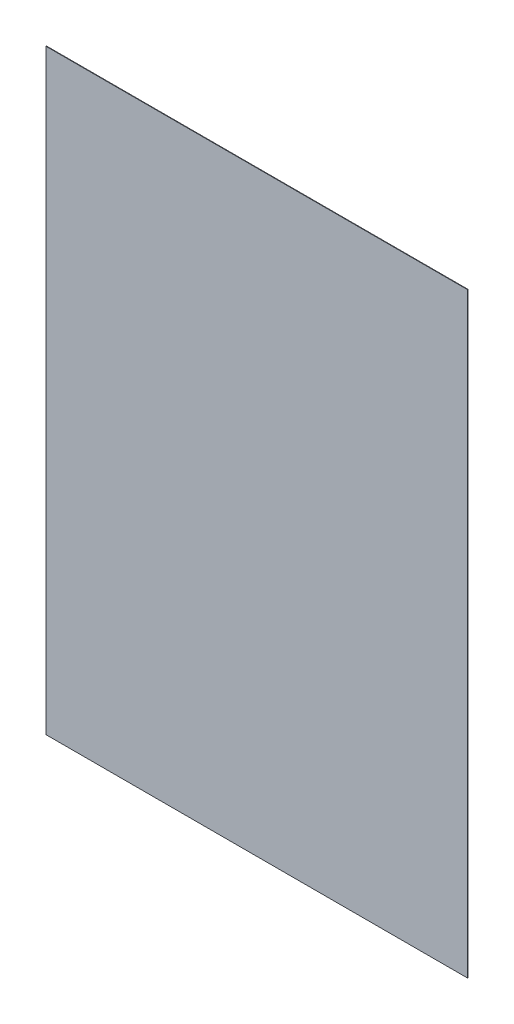
ISO-10303-21;
HEADER;
FILE_DESCRIPTION(('STEP AP214'),'2;1');
FILE_NAME('part.step','',(''),(''),'','','');
FILE_SCHEMA(('AUTOMOTIVE_DESIGN { 1 0 10303 214 1 1 1 1 }'));
ENDSEC;
DATA;
#1=APPLICATION_CONTEXT('core data for automotive mechanical design processes');
#2=APPLICATION_PROTOCOL_DEFINITION('international standard','automotive_design',2000,#1);
#3=PRODUCT_CONTEXT('',#1,'mechanical');
#4=PRODUCT('Part','Part','',(#3));
#5=PRODUCT_RELATED_PRODUCT_CATEGORY('part','',(#4));
#6=PRODUCT_DEFINITION_FORMATION('','',#4);
#7=PRODUCT_DEFINITION_CONTEXT('part definition',#1,'design');
#8=PRODUCT_DEFINITION('design','',#6,#7);
#9=PRODUCT_DEFINITION_SHAPE('','',#8);
#10=(LENGTH_UNIT() NAMED_UNIT(*) SI_UNIT(.MILLI.,.METRE.));
#11=(NAMED_UNIT(*) PLANE_ANGLE_UNIT() SI_UNIT($,.RADIAN.));
#12=(NAMED_UNIT(*) SI_UNIT($,.STERADIAN.) SOLID_ANGLE_UNIT());
#13=UNCERTAINTY_MEASURE_WITH_UNIT(LENGTH_MEASURE(1.E-05),#10,'distance_accuracy_value','');
#14=(GEOMETRIC_REPRESENTATION_CONTEXT(3) GLOBAL_UNCERTAINTY_ASSIGNED_CONTEXT((#13)) GLOBAL_UNIT_ASSIGNED_CONTEXT((#10,
#11,#12)) REPRESENTATION_CONTEXT('',''));
#15=CARTESIAN_POINT('',(0.,0.,0.));
#16=DIRECTION('',(0.,0.,1.));
#17=DIRECTION('',(1.,0.,0.));
#18=AXIS2_PLACEMENT_3D('',#15,#16,#17);
#19=CARTESIAN_POINT('',(0.,0.,0.253999999999992));
#20=DIRECTION('',(1.,0.,0.));
#21=DIRECTION('',(0.,1.,0.));
#22=AXIS2_PLACEMENT_3D('',#19,#20,#21);
#23=PLANE('',#22);
#24=DIRECTION('',(0.,-1.,0.));
#25=VECTOR('',#24,1.);
#26=CARTESIAN_POINT('',(0.,0.,0.));
#27=LINE('',#26,#25);
#28=CARTESIAN_POINT('',(0.,297.18,0.));
#29=VERTEX_POINT('',#28);
#30=CARTESIAN_POINT('',(0.,0.,0.));
#31=VERTEX_POINT('',#30);
#32=EDGE_CURVE('E113',#29,#31,#27,.T.);
#33=ORIENTED_EDGE('',*,*,#32,.T.);
#34=DIRECTION('',(0.,0.,-1.));
#35=VECTOR('',#34,1.);
#36=CARTESIAN_POINT('',(0.,0.,0.253999999999992));
#37=LINE('',#36,#35);
#38=CARTESIAN_POINT('',(0.,0.,0.253999999999992));
#39=VERTEX_POINT('',#38);
#40=EDGE_CURVE('E11',#39,#31,#37,.T.);
#41=ORIENTED_EDGE('',*,*,#40,.F.);
#42=DIRECTION('',(0.,-1.,0.));
#43=VECTOR('',#42,1.);
#44=CARTESIAN_POINT('',(0.,0.,0.253999999999992));
#45=LINE('',#44,#43);
#46=CARTESIAN_POINT('',(0.,297.18,0.253999999999992));
#47=VERTEX_POINT('',#46);
#48=EDGE_CURVE('E97',#47,#39,#45,.T.);
#49=ORIENTED_EDGE('',*,*,#48,.F.);
#50=DIRECTION('',(0.,0.,-1.));
#51=VECTOR('',#50,1.);
#52=CARTESIAN_POINT('',(0.,297.18,0.253999999999992));
#53=LINE('',#52,#51);
#54=EDGE_CURVE('E109',#47,#29,#53,.T.);
#55=ORIENTED_EDGE('',*,*,#54,.T.);
#56=EDGE_LOOP('',(#33,#41,#49,#55));
#57=FACE_BOUND('',#56,.T.);
#58=ADVANCED_FACE('F45',(#57),#23,.F.);
#59=CARTESIAN_POINT('',(0.,0.,0.253999999999992));
#60=DIRECTION('',(0.,1.,0.));
#61=DIRECTION('',(0.,0.,1.));
#62=AXIS2_PLACEMENT_3D('',#59,#60,#61);
#63=PLANE('',#62);
#64=DIRECTION('',(1.,0.,0.));
#65=VECTOR('',#64,1.);
#66=CARTESIAN_POINT('',(0.,0.,0.));
#67=LINE('',#66,#65);
#68=CARTESIAN_POINT('',(210.058,0.,0.));
#69=VERTEX_POINT('',#68);
#70=EDGE_CURVE('E102',#31,#69,#67,.T.);
#71=ORIENTED_EDGE('',*,*,#70,.T.);
#72=DIRECTION('',(0.,0.,-1.));
#73=VECTOR('',#72,1.);
#74=CARTESIAN_POINT('',(210.058,0.,0.253999999999992));
#75=LINE('',#74,#73);
#76=CARTESIAN_POINT('',(210.058,0.,0.253999999999992));
#77=VERTEX_POINT('',#76);
#78=EDGE_CURVE('E54',#77,#69,#75,.T.);
#79=ORIENTED_EDGE('',*,*,#78,.F.);
#80=DIRECTION('',(1.,0.,0.));
#81=VECTOR('',#80,1.);
#82=CARTESIAN_POINT('',(0.,0.,0.253999999999992));
#83=LINE('',#82,#81);
#84=EDGE_CURVE('E92',#39,#77,#83,.T.);
#85=ORIENTED_EDGE('',*,*,#84,.F.);
#86=ORIENTED_EDGE('',*,*,#40,.T.);
#87=EDGE_LOOP('',(#71,#79,#85,#86));
#88=FACE_BOUND('',#87,.T.);
#89=ADVANCED_FACE('F101',(#88),#63,.F.);
#90=CARTESIAN_POINT('',(210.058,0.,0.253999999999992));
#91=DIRECTION('',(-1.,0.,0.));
#92=DIRECTION('',(0.,-1.,0.));
#93=AXIS2_PLACEMENT_3D('',#90,#91,#92);
#94=PLANE('',#93);
#95=DIRECTION('',(0.,1.,0.));
#96=VECTOR('',#95,1.);
#97=CARTESIAN_POINT('',(210.058,0.,0.));
#98=LINE('',#97,#96);
#99=CARTESIAN_POINT('',(210.058,297.18,0.));
#100=VERTEX_POINT('',#99);
#101=EDGE_CURVE('E79',#69,#100,#98,.T.);
#102=ORIENTED_EDGE('',*,*,#101,.T.);
#103=DIRECTION('',(0.,0.,-1.));
#104=VECTOR('',#103,1.);
#105=CARTESIAN_POINT('',(210.058,297.18,0.253999999999992));
#106=LINE('',#105,#104);
#107=CARTESIAN_POINT('',(210.058,297.18,0.253999999999992));
#108=VERTEX_POINT('',#107);
#109=EDGE_CURVE('E104',#108,#100,#106,.T.);
#110=ORIENTED_EDGE('',*,*,#109,.F.);
#111=DIRECTION('',(0.,1.,0.));
#112=VECTOR('',#111,1.);
#113=CARTESIAN_POINT('',(210.058,0.,0.253999999999992));
#114=LINE('',#113,#112);
#115=EDGE_CURVE('E95',#77,#108,#114,.T.);
#116=ORIENTED_EDGE('',*,*,#115,.F.);
#117=ORIENTED_EDGE('',*,*,#78,.T.);
#118=EDGE_LOOP('',(#102,#110,#116,#117));
#119=FACE_BOUND('',#118,.T.);
#120=ADVANCED_FACE('F105',(#119),#94,.F.);
#121=CARTESIAN_POINT('',(0.,297.18,0.253999999999992));
#122=DIRECTION('',(0.,-1.,0.));
#123=DIRECTION('',(0.,0.,-1.));
#124=AXIS2_PLACEMENT_3D('',#121,#122,#123);
#125=PLANE('',#124);
#126=DIRECTION('',(-1.,0.,0.));
#127=VECTOR('',#126,1.);
#128=CARTESIAN_POINT('',(0.,297.18,0.));
#129=LINE('',#128,#127);
#130=EDGE_CURVE('E85',#100,#29,#129,.T.);
#131=ORIENTED_EDGE('',*,*,#130,.T.);
#132=ORIENTED_EDGE('',*,*,#54,.F.);
#133=DIRECTION('',(-1.,0.,0.));
#134=VECTOR('',#133,1.);
#135=CARTESIAN_POINT('',(0.,297.18,0.253999999999992));
#136=LINE('',#135,#134);
#137=EDGE_CURVE('E62',#108,#47,#136,.T.);
#138=ORIENTED_EDGE('',*,*,#137,.F.);
#139=ORIENTED_EDGE('',*,*,#109,.T.);
#140=EDGE_LOOP('',(#131,#132,#138,#139));
#141=FACE_BOUND('',#140,.T.);
#142=ADVANCED_FACE('F126',(#141),#125,.F.);
#143=CARTESIAN_POINT('',(0.,0.,0.253999999999992));
#144=DIRECTION('',(0.,0.,-1.));
#145=DIRECTION('',(-1.,0.,0.));
#146=AXIS2_PLACEMENT_3D('',#143,#144,#145);
#147=PLANE('',#146);
#148=ORIENTED_EDGE('',*,*,#48,.T.);
#149=ORIENTED_EDGE('',*,*,#84,.T.);
#150=ORIENTED_EDGE('',*,*,#115,.T.);
#151=ORIENTED_EDGE('',*,*,#137,.T.);
#152=EDGE_LOOP('',(#148,#149,#150,#151));
#153=FACE_BOUND('',#152,.T.);
#154=ADVANCED_FACE('F93',(#153),#147,.F.);
#155=CARTESIAN_POINT('',(0.,0.,0.));
#156=DIRECTION('',(0.,0.,-1.));
#157=DIRECTION('',(-1.,0.,0.));
#158=AXIS2_PLACEMENT_3D('',#155,#156,#157);
#159=PLANE('',#158);
#160=ORIENTED_EDGE('',*,*,#32,.F.);
#161=ORIENTED_EDGE('',*,*,#130,.F.);
#162=ORIENTED_EDGE('',*,*,#101,.F.);
#163=ORIENTED_EDGE('',*,*,#70,.F.);
#164=EDGE_LOOP('',(#160,#161,#162,#163));
#165=FACE_BOUND('',#164,.T.);
#166=ADVANCED_FACE('F129',(#165),#159,.T.);
#167=CLOSED_SHELL('',(#58,#89,#120,#142,#154,#166));
#168=MANIFOLD_SOLID_BREP('B2',#167);
#169=ADVANCED_BREP_SHAPE_REPRESENTATION('',(#18,#168),#14);
#170=SHAPE_DEFINITION_REPRESENTATION(#9,#169);
ENDSEC;
END-ISO-10303-21;
